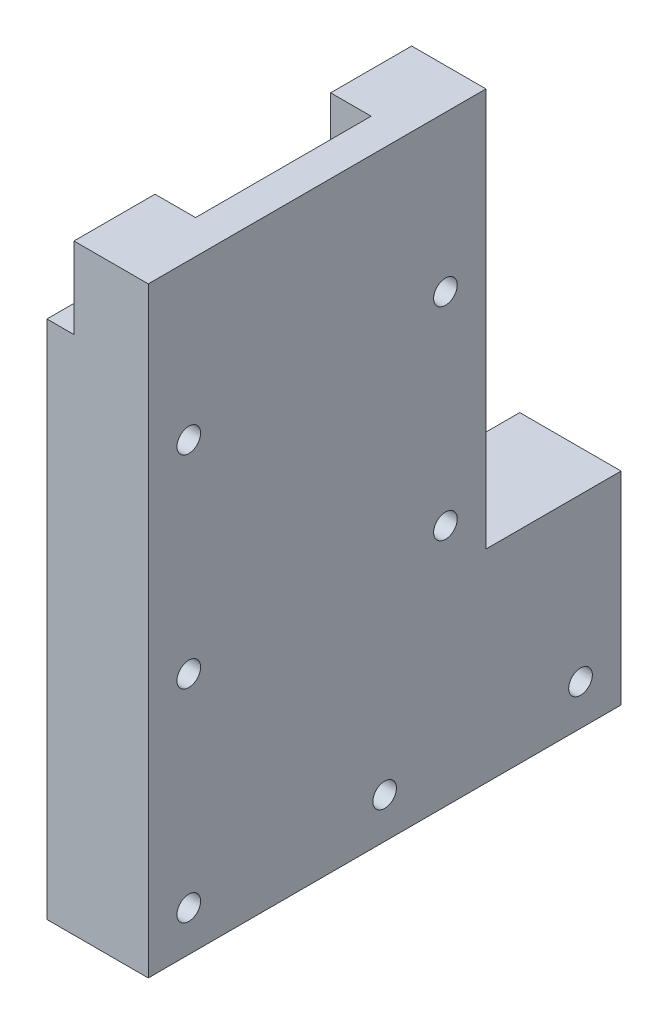
ISO-10303-21;
HEADER;
FILE_DESCRIPTION(('STEP AP214'),'2;1');
FILE_NAME('part.step','',(''),(''),'','','');
FILE_SCHEMA(('AUTOMOTIVE_DESIGN { 1 0 10303 214 1 1 1 1 }'));
ENDSEC;
DATA;
#1=APPLICATION_CONTEXT('core data for automotive mechanical design processes');
#2=APPLICATION_PROTOCOL_DEFINITION('international standard','automotive_design',2000,#1);
#3=PRODUCT_CONTEXT('',#1,'mechanical');
#4=PRODUCT('Part','Part','',(#3));
#5=PRODUCT_RELATED_PRODUCT_CATEGORY('part','',(#4));
#6=PRODUCT_DEFINITION_FORMATION('','',#4);
#7=PRODUCT_DEFINITION_CONTEXT('part definition',#1,'design');
#8=PRODUCT_DEFINITION('design','',#6,#7);
#9=PRODUCT_DEFINITION_SHAPE('','',#8);
#10=(LENGTH_UNIT() NAMED_UNIT(*) SI_UNIT(.MILLI.,.METRE.));
#11=(NAMED_UNIT(*) PLANE_ANGLE_UNIT() SI_UNIT($,.RADIAN.));
#12=(NAMED_UNIT(*) SI_UNIT($,.STERADIAN.) SOLID_ANGLE_UNIT());
#13=UNCERTAINTY_MEASURE_WITH_UNIT(LENGTH_MEASURE(1.E-05),#10,'distance_accuracy_value','');
#14=(GEOMETRIC_REPRESENTATION_CONTEXT(3) GLOBAL_UNCERTAINTY_ASSIGNED_CONTEXT((#13)) GLOBAL_UNIT_ASSIGNED_CONTEXT((#10,
#11,#12)) REPRESENTATION_CONTEXT('',''));
#15=CARTESIAN_POINT('',(0.,0.,0.));
#16=DIRECTION('',(0.,0.,1.));
#17=DIRECTION('',(1.,0.,0.));
#18=AXIS2_PLACEMENT_3D('',#15,#16,#17);
#19=CARTESIAN_POINT('',(25.,-32.5,13.));
#20=DIRECTION('',(0.,-1.,0.));
#21=DIRECTION('',(0.,0.,-1.));
#22=AXIS2_PLACEMENT_3D('',#19,#20,#21);
#23=PLANE('',#22);
#24=DIRECTION('',(0.,0.,-1.));
#25=VECTOR('',#24,1.);
#26=CARTESIAN_POINT('',(15.,-32.5,13.));
#27=LINE('',#26,#25);
#28=CARTESIAN_POINT('',(15.,-32.5,11.));
#29=VERTEX_POINT('',#28);
#30=CARTESIAN_POINT('',(15.,-32.5,-31.));
#31=VERTEX_POINT('',#30);
#32=EDGE_CURVE('E213',#29,#31,#27,.T.);
#33=ORIENTED_EDGE('',*,*,#32,.F.);
#34=DIRECTION('',(1.,0.,0.));
#35=VECTOR('',#34,1.);
#36=CARTESIAN_POINT('',(22.,-32.5,11.));
#37=LINE('',#36,#35);
#38=CARTESIAN_POINT('',(25.,-32.5,11.));
#39=VERTEX_POINT('',#38);
#40=EDGE_CURVE('E269',#29,#39,#37,.T.);
#41=ORIENTED_EDGE('',*,*,#40,.T.);
#42=DIRECTION('',(0.,0.,-1.));
#43=VECTOR('',#42,1.);
#44=CARTESIAN_POINT('',(25.,-32.5,13.));
#45=LINE('',#44,#43);
#46=CARTESIAN_POINT('',(25.,-32.5,-31.));
#47=VERTEX_POINT('',#46);
#48=EDGE_CURVE('E329',#39,#47,#45,.T.);
#49=ORIENTED_EDGE('',*,*,#48,.T.);
#50=DIRECTION('',(1.,0.,0.));
#51=VECTOR('',#50,1.);
#52=CARTESIAN_POINT('',(22.,-32.5,-31.));
#53=LINE('',#52,#51);
#54=EDGE_CURVE('E241',#31,#47,#53,.T.);
#55=ORIENTED_EDGE('',*,*,#54,.F.);
#56=EDGE_LOOP('',(#33,#41,#49,#55));
#57=FACE_BOUND('',#56,.T.);
#58=ADVANCED_FACE('F35',(#57),#23,.F.);
#59=CARTESIAN_POINT('',(25.,-29.5,-33.));
#60=DIRECTION('',(0.,0.,-1.));
#61=DIRECTION('',(1.,0.,0.));
#62=AXIS2_PLACEMENT_3D('',#59,#60,#61);
#63=PLANE('',#62);
#64=DIRECTION('',(1.,0.,0.));
#65=VECTOR('',#64,1.);
#66=CARTESIAN_POINT('',(15.,-31.5,-33.));
#67=LINE('',#66,#65);
#68=CARTESIAN_POINT('',(15.,-31.5,-33.));
#69=VERTEX_POINT('',#68);
#70=CARTESIAN_POINT('',(22.,-31.5,-33.));
#71=VERTEX_POINT('',#70);
#72=EDGE_CURVE('E203',#69,#71,#67,.T.);
#73=ORIENTED_EDGE('',*,*,#72,.T.);
#74=DIRECTION('',(0.,1.,0.));
#75=VECTOR('',#74,1.);
#76=CARTESIAN_POINT('',(22.,-32.5,-33.));
#77=LINE('',#76,#75);
#78=CARTESIAN_POINT('',(22.,-30.5,-33.));
#79=VERTEX_POINT('',#78);
#80=EDGE_CURVE('E233',#71,#79,#77,.T.);
#81=ORIENTED_EDGE('',*,*,#80,.T.);
#82=DIRECTION('',(1.,0.,0.));
#83=VECTOR('',#82,1.);
#84=CARTESIAN_POINT('',(22.,-30.5,-33.));
#85=LINE('',#84,#83);
#86=CARTESIAN_POINT('',(25.,-30.5,-33.));
#87=VERTEX_POINT('',#86);
#88=EDGE_CURVE('E248',#79,#87,#85,.T.);
#89=ORIENTED_EDGE('',*,*,#88,.T.);
#90=DIRECTION('',(0.,1.,0.));
#91=VECTOR('',#90,1.);
#92=CARTESIAN_POINT('',(25.,-29.5,-33.));
#93=LINE('',#92,#91);
#94=CARTESIAN_POINT('',(25.,-29.5,-33.));
#95=VERTEX_POINT('',#94);
#96=EDGE_CURVE('E313',#87,#95,#93,.T.);
#97=ORIENTED_EDGE('',*,*,#96,.T.);
#98=DIRECTION('',(-1.,0.,0.));
#99=VECTOR('',#98,1.);
#100=CARTESIAN_POINT('',(25.,-29.5,-33.));
#101=LINE('',#100,#99);
#102=CARTESIAN_POINT('',(15.,-29.5,-33.));
#103=VERTEX_POINT('',#102);
#104=EDGE_CURVE('E320',#95,#103,#101,.T.);
#105=ORIENTED_EDGE('',*,*,#104,.T.);
#106=DIRECTION('',(0.,1.,0.));
#107=VECTOR('',#106,1.);
#108=CARTESIAN_POINT('',(15.,-29.5,-33.));
#109=LINE('',#108,#107);
#110=EDGE_CURVE('E314',#69,#103,#109,.T.);
#111=ORIENTED_EDGE('',*,*,#110,.F.);
#112=EDGE_LOOP('',(#73,#81,#89,#97,#105,#111));
#113=FACE_BOUND('',#112,.T.);
#114=ADVANCED_FACE('F445',(#113),#63,.F.);
#115=CARTESIAN_POINT('',(22.,0.,0.));
#116=DIRECTION('',(-1.,0.,0.));
#117=DIRECTION('',(0.,0.,-1.));
#118=AXIS2_PLACEMENT_3D('',#115,#116,#117);
#119=PLANE('',#118);
#120=DIRECTION('',(0.,-1.,0.));
#121=VECTOR('',#120,1.);
#122=CARTESIAN_POINT('',(22.,-32.5,-31.));
#123=LINE('',#122,#121);
#124=CARTESIAN_POINT('',(22.,-30.5,-31.));
#125=VERTEX_POINT('',#124);
#126=CARTESIAN_POINT('',(22.,-31.5,-31.));
#127=VERTEX_POINT('',#126);
#128=EDGE_CURVE('E200',#125,#127,#123,.T.);
#129=ORIENTED_EDGE('',*,*,#128,.F.);
#130=DIRECTION('',(0.,0.,1.));
#131=VECTOR('',#130,1.);
#132=CARTESIAN_POINT('',(22.,-30.5,-33.));
#133=LINE('',#132,#131);
#134=EDGE_CURVE('E236',#79,#125,#133,.T.);
#135=ORIENTED_EDGE('',*,*,#134,.F.);
#136=ORIENTED_EDGE('',*,*,#80,.F.);
#137=DIRECTION('',(0.,0.,1.));
#138=VECTOR('',#137,1.);
#139=CARTESIAN_POINT('',(22.,-31.5,-33.));
#140=LINE('',#139,#138);
#141=EDGE_CURVE('E208',#71,#127,#140,.T.);
#142=ORIENTED_EDGE('',*,*,#141,.T.);
#143=EDGE_LOOP('',(#129,#135,#136,#142));
#144=FACE_BOUND('',#143,.T.);
#145=ADVANCED_FACE('F443',(#144),#119,.T.);
#146=CARTESIAN_POINT('',(25.,44.5,13.));
#147=DIRECTION('',(0.,0.,1.));
#148=DIRECTION('',(0.,-1.,0.));
#149=AXIS2_PLACEMENT_3D('',#146,#147,#148);
#150=PLANE('',#149);
#151=DIRECTION('',(1.,0.,0.));
#152=VECTOR('',#151,1.);
#153=CARTESIAN_POINT('',(15.,-31.5,13.));
#154=LINE('',#153,#152);
#155=CARTESIAN_POINT('',(15.,-31.5,13.));
#156=VERTEX_POINT('',#155);
#157=CARTESIAN_POINT('',(22.,-31.5,13.));
#158=VERTEX_POINT('',#157);
#159=EDGE_CURVE('E226',#156,#158,#154,.T.);
#160=ORIENTED_EDGE('',*,*,#159,.F.);
#161=DIRECTION('',(0.,-1.,0.));
#162=VECTOR('',#161,1.);
#163=CARTESIAN_POINT('',(15.,44.5,13.));
#164=LINE('',#163,#162);
#165=CARTESIAN_POINT('',(15.,32.5,13.));
#166=VERTEX_POINT('',#165);
#167=EDGE_CURVE('E323',#166,#156,#164,.T.);
#168=ORIENTED_EDGE('',*,*,#167,.F.);
#169=DIRECTION('',(-1.,0.,0.));
#170=VECTOR('',#169,1.);
#171=CARTESIAN_POINT('',(19.,32.5,13.));
#172=LINE('',#171,#170);
#173=CARTESIAN_POINT('',(19.,32.5,13.));
#174=VERTEX_POINT('',#173);
#175=EDGE_CURVE('E288',#174,#166,#172,.T.);
#176=ORIENTED_EDGE('',*,*,#175,.F.);
#177=DIRECTION('',(0.,1.,0.));
#178=VECTOR('',#177,1.);
#179=CARTESIAN_POINT('',(19.,44.5,13.));
#180=LINE('',#179,#178);
#181=CARTESIAN_POINT('',(19.,44.5,13.));
#182=VERTEX_POINT('',#181);
#183=EDGE_CURVE('E279',#174,#182,#180,.T.);
#184=ORIENTED_EDGE('',*,*,#183,.T.);
#185=DIRECTION('',(-1.,0.,0.));
#186=VECTOR('',#185,1.);
#187=CARTESIAN_POINT('',(25.,44.5,13.));
#188=LINE('',#187,#186);
#189=CARTESIAN_POINT('',(25.,44.5,13.));
#190=VERTEX_POINT('',#189);
#191=EDGE_CURVE('E344',#190,#182,#188,.T.);
#192=ORIENTED_EDGE('',*,*,#191,.F.);
#193=DIRECTION('',(0.,-1.,0.));
#194=VECTOR('',#193,1.);
#195=CARTESIAN_POINT('',(25.,44.5,13.));
#196=LINE('',#195,#194);
#197=CARTESIAN_POINT('',(25.,-30.5,13.));
#198=VERTEX_POINT('',#197);
#199=EDGE_CURVE('E326',#190,#198,#196,.T.);
#200=ORIENTED_EDGE('',*,*,#199,.T.);
#201=DIRECTION('',(1.,0.,0.));
#202=VECTOR('',#201,1.);
#203=CARTESIAN_POINT('',(22.,-30.5,13.));
#204=LINE('',#203,#202);
#205=CARTESIAN_POINT('',(22.,-30.5,13.));
#206=VERTEX_POINT('',#205);
#207=EDGE_CURVE('E261',#206,#198,#204,.T.);
#208=ORIENTED_EDGE('',*,*,#207,.F.);
#209=DIRECTION('',(0.,-1.,0.));
#210=VECTOR('',#209,1.);
#211=CARTESIAN_POINT('',(22.,-32.5,13.));
#212=LINE('',#211,#210);
#213=EDGE_CURVE('E252',#206,#158,#212,.T.);
#214=ORIENTED_EDGE('',*,*,#213,.T.);
#215=EDGE_LOOP('',(#160,#168,#176,#184,#192,#200,#208,#214));
#216=FACE_BOUND('',#215,.T.);
#217=ADVANCED_FACE('F424',(#216),#150,.F.);
#218=CARTESIAN_POINT('',(22.,0.,0.));
#219=DIRECTION('',(1.,0.,0.));
#220=DIRECTION('',(0.,0.,1.));
#221=AXIS2_PLACEMENT_3D('',#218,#219,#220);
#222=PLANE('',#221);
#223=DIRECTION('',(0.,0.,1.));
#224=VECTOR('',#223,1.);
#225=CARTESIAN_POINT('',(22.,-31.5,13.));
#226=LINE('',#225,#224);
#227=CARTESIAN_POINT('',(22.,-31.5,11.));
#228=VERTEX_POINT('',#227);
#229=EDGE_CURVE('E220',#228,#158,#226,.T.);
#230=ORIENTED_EDGE('',*,*,#229,.T.);
#231=ORIENTED_EDGE('',*,*,#213,.F.);
#232=DIRECTION('',(0.,0.,1.));
#233=VECTOR('',#232,1.);
#234=CARTESIAN_POINT('',(22.,-30.5,13.));
#235=LINE('',#234,#233);
#236=CARTESIAN_POINT('',(22.,-30.5,11.));
#237=VERTEX_POINT('',#236);
#238=EDGE_CURVE('E259',#237,#206,#235,.T.);
#239=ORIENTED_EDGE('',*,*,#238,.F.);
#240=DIRECTION('',(0.,1.,0.));
#241=VECTOR('',#240,1.);
#242=CARTESIAN_POINT('',(22.,-32.5,11.));
#243=LINE('',#242,#241);
#244=EDGE_CURVE('E255',#228,#237,#243,.T.);
#245=ORIENTED_EDGE('',*,*,#244,.F.);
#246=EDGE_LOOP('',(#230,#231,#239,#245));
#247=FACE_BOUND('',#246,.T.);
#248=ADVANCED_FACE('F486',(#247),#222,.F.);
#249=CARTESIAN_POINT('',(25.,0.,0.));
#250=DIRECTION('',(-1.,0.,0.));
#251=DIRECTION('',(0.,0.,-1.));
#252=AXIS2_PLACEMENT_3D('',#249,#250,#251);
#253=PLANE('',#252);
#254=DIRECTION('',(0.,-1.,0.));
#255=VECTOR('',#254,1.);
#256=CARTESIAN_POINT('',(25.,-32.5,-31.));
#257=LINE('',#256,#255);
#258=CARTESIAN_POINT('',(25.,-30.5,-31.));
#259=VERTEX_POINT('',#258);
#260=EDGE_CURVE('E237',#259,#47,#257,.T.);
#261=ORIENTED_EDGE('',*,*,#260,.T.);
#262=ORIENTED_EDGE('',*,*,#48,.F.);
#263=DIRECTION('',(0.,1.,0.));
#264=VECTOR('',#263,1.);
#265=CARTESIAN_POINT('',(25.,-32.5,11.));
#266=LINE('',#265,#264);
#267=CARTESIAN_POINT('',(25.,-30.5,11.));
#268=VERTEX_POINT('',#267);
#269=EDGE_CURVE('E251',#39,#268,#266,.T.);
#270=ORIENTED_EDGE('',*,*,#269,.T.);
#271=DIRECTION('',(0.,0.,1.));
#272=VECTOR('',#271,1.);
#273=CARTESIAN_POINT('',(25.,-30.5,13.));
#274=LINE('',#273,#272);
#275=EDGE_CURVE('E256',#268,#198,#274,.T.);
#276=ORIENTED_EDGE('',*,*,#275,.T.);
#277=ORIENTED_EDGE('',*,*,#199,.F.);
#278=DIRECTION('',(0.,0.,1.));
#279=VECTOR('',#278,1.);
#280=CARTESIAN_POINT('',(25.,44.5,13.));
#281=LINE('',#280,#279);
#282=CARTESIAN_POINT('',(25.,44.5,-13.));
#283=VERTEX_POINT('',#282);
#284=EDGE_CURVE('E336',#283,#190,#281,.T.);
#285=ORIENTED_EDGE('',*,*,#284,.F.);
#286=DIRECTION('',(0.,1.,0.));
#287=VECTOR('',#286,1.);
#288=CARTESIAN_POINT('',(25.,44.5,-13.));
#289=LINE('',#288,#287);
#290=CARTESIAN_POINT('',(25.,-9.50000000000001,-13.));
#291=VERTEX_POINT('',#290);
#292=EDGE_CURVE('E333',#291,#283,#289,.T.);
#293=ORIENTED_EDGE('',*,*,#292,.F.);
#294=CARTESIAN_POINT('',(25.,-9.50000000000001,-33.));
#295=DIRECTION('',(-1.,0.,0.));
#296=DIRECTION('',(0.,0.,-1.));
#297=AXIS2_PLACEMENT_3D('',#294,#295,#296);
#298=CIRCLE('',#297,20.);
#299=EDGE_CURVE('E310',#95,#291,#298,.T.);
#300=ORIENTED_EDGE('',*,*,#299,.F.);
#301=ORIENTED_EDGE('',*,*,#96,.F.);
#302=DIRECTION('',(0.,0.,1.));
#303=VECTOR('',#302,1.);
#304=CARTESIAN_POINT('',(25.,-30.5,-33.));
#305=LINE('',#304,#303);
#306=EDGE_CURVE('E232',#87,#259,#305,.T.);
#307=ORIENTED_EDGE('',*,*,#306,.T.);
#308=EDGE_LOOP('',(#261,#262,#270,#276,#277,#285,#293,#300,#301,#307));
#309=FACE_BOUND('',#308,.T.);
#310=ADVANCED_FACE('F436',(#309),#253,.T.);
#311=CARTESIAN_POINT('',(15.,44.5,25.));
#312=DIRECTION('',(0.,-1.,0.));
#313=DIRECTION('',(0.,0.,-1.));
#314=AXIS2_PLACEMENT_3D('',#311,#312,#313);
#315=PLANE('',#314);
#316=DIRECTION('',(0.,0.,1.));
#317=VECTOR('',#316,1.);
#318=CARTESIAN_POINT('',(19.,44.5,25.));
#319=LINE('',#318,#317);
#320=CARTESIAN_POINT('',(19.,44.5,25.));
#321=VERTEX_POINT('',#320);
#322=EDGE_CURVE('E282',#182,#321,#319,.T.);
#323=ORIENTED_EDGE('',*,*,#322,.T.);
#324=DIRECTION('',(1.,0.,0.));
#325=VECTOR('',#324,1.);
#326=CARTESIAN_POINT('',(15.,44.5,25.));
#327=LINE('',#326,#325);
#328=CARTESIAN_POINT('',(30.,44.5,25.));
#329=VERTEX_POINT('',#328);
#330=EDGE_CURVE('E382',#321,#329,#327,.T.);
#331=ORIENTED_EDGE('',*,*,#330,.T.);
#332=DIRECTION('',(0.,0.,1.));
#333=VECTOR('',#332,1.);
#334=CARTESIAN_POINT('',(30.,44.5,25.));
#335=LINE('',#334,#333);
#336=CARTESIAN_POINT('',(30.,44.5,-25.));
#337=VERTEX_POINT('',#336);
#338=EDGE_CURVE('E373',#337,#329,#335,.T.);
#339=ORIENTED_EDGE('',*,*,#338,.F.);
#340=DIRECTION('',(1.,0.,0.));
#341=VECTOR('',#340,1.);
#342=CARTESIAN_POINT('',(15.,44.5,-25.));
#343=LINE('',#342,#341);
#344=CARTESIAN_POINT('',(19.,44.5,-25.));
#345=VERTEX_POINT('',#344);
#346=EDGE_CURVE('E385',#345,#337,#343,.T.);
#347=ORIENTED_EDGE('',*,*,#346,.F.);
#348=DIRECTION('',(0.,0.,1.));
#349=VECTOR('',#348,1.);
#350=CARTESIAN_POINT('',(19.,44.5,-13.));
#351=LINE('',#350,#349);
#352=CARTESIAN_POINT('',(19.,44.5,-13.));
#353=VERTEX_POINT('',#352);
#354=EDGE_CURVE('E301',#345,#353,#351,.T.);
#355=ORIENTED_EDGE('',*,*,#354,.T.);
#356=DIRECTION('',(-1.,0.,0.));
#357=VECTOR('',#356,1.);
#358=CARTESIAN_POINT('',(25.,44.5,-13.));
#359=LINE('',#358,#357);
#360=EDGE_CURVE('E338',#283,#353,#359,.T.);
#361=ORIENTED_EDGE('',*,*,#360,.F.);
#362=ORIENTED_EDGE('',*,*,#284,.T.);
#363=ORIENTED_EDGE('',*,*,#191,.T.);
#364=EDGE_LOOP('',(#323,#331,#339,#347,#355,#361,#362,#363));
#365=FACE_BOUND('',#364,.T.);
#366=ADVANCED_FACE('F412',(#365),#315,.F.);
#367=CARTESIAN_POINT('',(25.,44.5,-13.));
#368=DIRECTION('',(0.,0.,-1.));
#369=DIRECTION('',(0.,1.,0.));
#370=AXIS2_PLACEMENT_3D('',#367,#368,#369);
#371=PLANE('',#370);
#372=DIRECTION('',(0.,1.,0.));
#373=VECTOR('',#372,1.);
#374=CARTESIAN_POINT('',(15.,44.5,-13.));
#375=LINE('',#374,#373);
#376=CARTESIAN_POINT('',(15.,-9.50000000000001,-13.));
#377=VERTEX_POINT('',#376);
#378=CARTESIAN_POINT('',(15.,32.5,-13.));
#379=VERTEX_POINT('',#378);
#380=EDGE_CURVE('E330',#377,#379,#375,.T.);
#381=ORIENTED_EDGE('',*,*,#380,.F.);
#382=DIRECTION('',(-1.,0.,0.));
#383=VECTOR('',#382,1.);
#384=CARTESIAN_POINT('',(25.,-9.50000000000001,-13.));
#385=LINE('',#384,#383);
#386=EDGE_CURVE('E317',#291,#377,#385,.T.);
#387=ORIENTED_EDGE('',*,*,#386,.F.);
#388=ORIENTED_EDGE('',*,*,#292,.T.);
#389=ORIENTED_EDGE('',*,*,#360,.T.);
#390=DIRECTION('',(0.,-1.,0.));
#391=VECTOR('',#390,1.);
#392=CARTESIAN_POINT('',(19.,44.5,-13.));
#393=LINE('',#392,#391);
#394=CARTESIAN_POINT('',(19.,32.5,-13.));
#395=VERTEX_POINT('',#394);
#396=EDGE_CURVE('E294',#353,#395,#393,.T.);
#397=ORIENTED_EDGE('',*,*,#396,.T.);
#398=DIRECTION('',(-1.,0.,0.));
#399=VECTOR('',#398,1.);
#400=CARTESIAN_POINT('',(19.,32.5,-13.));
#401=LINE('',#400,#399);
#402=EDGE_CURVE('E304',#395,#379,#401,.T.);
#403=ORIENTED_EDGE('',*,*,#402,.T.);
#404=EDGE_LOOP('',(#381,#387,#388,#389,#397,#403));
#405=FACE_BOUND('',#404,.T.);
#406=ADVANCED_FACE('F452',(#405),#371,.F.);
#407=CARTESIAN_POINT('',(15.,-14.5,-45.));
#408=DIRECTION('',(0.,0.,1.));
#409=DIRECTION('',(0.,-1.,0.));
#410=AXIS2_PLACEMENT_3D('',#407,#408,#409);
#411=PLANE('',#410);
#412=DIRECTION('',(0.,1.,0.));
#413=VECTOR('',#412,1.);
#414=CARTESIAN_POINT('',(30.,-14.5,-45.));
#415=LINE('',#414,#413);
#416=CARTESIAN_POINT('',(30.,-44.5,-45.));
#417=VERTEX_POINT('',#416);
#418=CARTESIAN_POINT('',(30.,-14.5,-45.));
#419=VERTEX_POINT('',#418);
#420=EDGE_CURVE('E347',#417,#419,#415,.T.);
#421=ORIENTED_EDGE('',*,*,#420,.F.);
#422=DIRECTION('',(1.,0.,0.));
#423=VECTOR('',#422,1.);
#424=CARTESIAN_POINT('',(15.,-44.5,-45.));
#425=LINE('',#424,#423);
#426=CARTESIAN_POINT('',(15.,-44.5,-45.));
#427=VERTEX_POINT('',#426);
#428=EDGE_CURVE('E11',#427,#417,#425,.T.);
#429=ORIENTED_EDGE('',*,*,#428,.F.);
#430=DIRECTION('',(0.,1.,0.));
#431=VECTOR('',#430,1.);
#432=CARTESIAN_POINT('',(15.,-14.5,-45.));
#433=LINE('',#432,#431);
#434=CARTESIAN_POINT('',(15.,-14.5,-45.));
#435=VERTEX_POINT('',#434);
#436=EDGE_CURVE('E352',#427,#435,#433,.T.);
#437=ORIENTED_EDGE('',*,*,#436,.T.);
#438=DIRECTION('',(1.,0.,0.));
#439=VECTOR('',#438,1.);
#440=CARTESIAN_POINT('',(15.,-14.5,-45.));
#441=LINE('',#440,#439);
#442=EDGE_CURVE('E43',#435,#419,#441,.T.);
#443=ORIENTED_EDGE('',*,*,#442,.T.);
#444=EDGE_LOOP('',(#421,#429,#437,#443));
#445=FACE_BOUND('',#444,.T.);
#446=ADVANCED_FACE('F37',(#445),#411,.F.);
#447=CARTESIAN_POINT('',(15.,-14.5,-25.));
#448=DIRECTION('',(0.,-1.,0.));
#449=DIRECTION('',(0.,0.,-1.));
#450=AXIS2_PLACEMENT_3D('',#447,#448,#449);
#451=PLANE('',#450);
#452=DIRECTION('',(0.,0.,1.));
#453=VECTOR('',#452,1.);
#454=CARTESIAN_POINT('',(30.,-14.5,-25.));
#455=LINE('',#454,#453);
#456=CARTESIAN_POINT('',(30.,-14.5,-25.));
#457=VERTEX_POINT('',#456);
#458=EDGE_CURVE('E368',#419,#457,#455,.T.);
#459=ORIENTED_EDGE('',*,*,#458,.F.);
#460=ORIENTED_EDGE('',*,*,#442,.F.);
#461=DIRECTION('',(0.,0.,1.));
#462=VECTOR('',#461,1.);
#463=CARTESIAN_POINT('',(15.,-14.5,-25.));
#464=LINE('',#463,#462);
#465=CARTESIAN_POINT('',(15.,-14.5,-25.));
#466=VERTEX_POINT('',#465);
#467=EDGE_CURVE('E356',#435,#466,#464,.T.);
#468=ORIENTED_EDGE('',*,*,#467,.T.);
#469=DIRECTION('',(1.,0.,0.));
#470=VECTOR('',#469,1.);
#471=CARTESIAN_POINT('',(15.,-14.5,-25.));
#472=LINE('',#471,#470);
#473=EDGE_CURVE('E388',#466,#457,#472,.T.);
#474=ORIENTED_EDGE('',*,*,#473,.T.);
#475=EDGE_LOOP('',(#459,#460,#468,#474));
#476=FACE_BOUND('',#475,.T.);
#477=ADVANCED_FACE('F404',(#476),#451,.F.);
#478=CARTESIAN_POINT('',(15.,44.5,-25.));
#479=DIRECTION('',(0.,0.,1.));
#480=DIRECTION('',(0.,-1.,0.));
#481=AXIS2_PLACEMENT_3D('',#478,#479,#480);
#482=PLANE('',#481);
#483=DIRECTION('',(0.,1.,0.));
#484=VECTOR('',#483,1.);
#485=CARTESIAN_POINT('',(19.,44.5,-25.));
#486=LINE('',#485,#484);
#487=CARTESIAN_POINT('',(19.,32.5,-25.));
#488=VERTEX_POINT('',#487);
#489=EDGE_CURVE('E299',#488,#345,#486,.T.);
#490=ORIENTED_EDGE('',*,*,#489,.T.);
#491=ORIENTED_EDGE('',*,*,#346,.T.);
#492=DIRECTION('',(0.,1.,0.));
#493=VECTOR('',#492,1.);
#494=CARTESIAN_POINT('',(30.,44.5,-25.));
#495=LINE('',#494,#493);
#496=EDGE_CURVE('E371',#457,#337,#495,.T.);
#497=ORIENTED_EDGE('',*,*,#496,.F.);
#498=ORIENTED_EDGE('',*,*,#473,.F.);
#499=DIRECTION('',(0.,1.,0.));
#500=VECTOR('',#499,1.);
#501=CARTESIAN_POINT('',(15.,44.5,-25.));
#502=LINE('',#501,#500);
#503=CARTESIAN_POINT('',(15.,32.5,-25.));
#504=VERTEX_POINT('',#503);
#505=EDGE_CURVE('E359',#466,#504,#502,.T.);
#506=ORIENTED_EDGE('',*,*,#505,.T.);
#507=DIRECTION('',(-1.,0.,0.));
#508=VECTOR('',#507,1.);
#509=CARTESIAN_POINT('',(19.,32.5,-25.));
#510=LINE('',#509,#508);
#511=EDGE_CURVE('E287',#488,#504,#510,.T.);
#512=ORIENTED_EDGE('',*,*,#511,.F.);
#513=EDGE_LOOP('',(#490,#491,#497,#498,#506,#512));
#514=FACE_BOUND('',#513,.T.);
#515=ADVANCED_FACE('F406',(#514),#482,.F.);
#516=CARTESIAN_POINT('',(15.,44.5,25.));
#517=DIRECTION('',(0.,0.,-1.));
#518=DIRECTION('',(0.,1.,0.));
#519=AXIS2_PLACEMENT_3D('',#516,#517,#518);
#520=PLANE('',#519);
#521=DIRECTION('',(0.,-1.,0.));
#522=VECTOR('',#521,1.);
#523=CARTESIAN_POINT('',(15.,44.5,25.));
#524=LINE('',#523,#522);
#525=CARTESIAN_POINT('',(15.,32.5,25.));
#526=VERTEX_POINT('',#525);
#527=CARTESIAN_POINT('',(15.,-44.5,25.));
#528=VERTEX_POINT('',#527);
#529=EDGE_CURVE('E362',#526,#528,#524,.T.);
#530=ORIENTED_EDGE('',*,*,#529,.T.);
#531=DIRECTION('',(1.,0.,0.));
#532=VECTOR('',#531,1.);
#533=CARTESIAN_POINT('',(15.,-44.5,25.));
#534=LINE('',#533,#532);
#535=CARTESIAN_POINT('',(30.,-44.5,25.));
#536=VERTEX_POINT('',#535);
#537=EDGE_CURVE('E365',#528,#536,#534,.T.);
#538=ORIENTED_EDGE('',*,*,#537,.T.);
#539=DIRECTION('',(0.,-1.,0.));
#540=VECTOR('',#539,1.);
#541=CARTESIAN_POINT('',(30.,44.5,25.));
#542=LINE('',#541,#540);
#543=EDGE_CURVE('E376',#329,#536,#542,.T.);
#544=ORIENTED_EDGE('',*,*,#543,.F.);
#545=ORIENTED_EDGE('',*,*,#330,.F.);
#546=DIRECTION('',(0.,-1.,0.));
#547=VECTOR('',#546,1.);
#548=CARTESIAN_POINT('',(19.,44.5,25.));
#549=LINE('',#548,#547);
#550=CARTESIAN_POINT('',(19.,32.5,25.));
#551=VERTEX_POINT('',#550);
#552=EDGE_CURVE('E273',#321,#551,#549,.T.);
#553=ORIENTED_EDGE('',*,*,#552,.T.);
#554=DIRECTION('',(-1.,0.,0.));
#555=VECTOR('',#554,1.);
#556=CARTESIAN_POINT('',(19.,32.5,25.));
#557=LINE('',#556,#555);
#558=EDGE_CURVE('E285',#551,#526,#557,.T.);
#559=ORIENTED_EDGE('',*,*,#558,.T.);
#560=EDGE_LOOP('',(#530,#538,#544,#545,#553,#559));
#561=FACE_BOUND('',#560,.T.);
#562=ADVANCED_FACE('F414',(#561),#520,.F.);
#563=CARTESIAN_POINT('',(15.,-44.5,25.));
#564=DIRECTION('',(0.,1.,0.));
#565=DIRECTION('',(0.,0.,1.));
#566=AXIS2_PLACEMENT_3D('',#563,#564,#565);
#567=PLANE('',#566);
#568=DIRECTION('',(0.,0.,-1.));
#569=VECTOR('',#568,1.);
#570=CARTESIAN_POINT('',(30.,-44.5,25.));
#571=LINE('',#570,#569);
#572=EDGE_CURVE('E353',#536,#417,#571,.T.);
#573=ORIENTED_EDGE('',*,*,#572,.F.);
#574=ORIENTED_EDGE('',*,*,#537,.F.);
#575=DIRECTION('',(0.,0.,-1.));
#576=VECTOR('',#575,1.);
#577=CARTESIAN_POINT('',(15.,-44.5,-25.));
#578=LINE('',#577,#576);
#579=EDGE_CURVE('E350',#528,#427,#578,.T.);
#580=ORIENTED_EDGE('',*,*,#579,.T.);
#581=ORIENTED_EDGE('',*,*,#428,.T.);
#582=EDGE_LOOP('',(#573,#574,#580,#581));
#583=FACE_BOUND('',#582,.T.);
#584=ADVANCED_FACE('F401',(#583),#567,.F.);
#585=CARTESIAN_POINT('',(15.,0.,0.));
#586=DIRECTION('',(1.,0.,0.));
#587=DIRECTION('',(0.,0.,1.));
#588=AXIS2_PLACEMENT_3D('',#585,#586,#587);
#589=PLANE('',#588);
#590=CARTESIAN_POINT('',(15.,-8.50000000000001,19.));
#591=DIRECTION('',(1.,0.,0.));
#592=DIRECTION('',(0.,0.,-1.));
#593=AXIS2_PLACEMENT_3D('',#590,#591,#592);
#594=CIRCLE('',#593,1.75);
#595=CARTESIAN_POINT('',(15.,-8.50000000000001,17.25));
#596=VERTEX_POINT('',#595);
#597=EDGE_CURVE('E768',#596,#596,#594,.T.);
#598=ORIENTED_EDGE('',*,*,#597,.T.);
#599=EDGE_LOOP('',(#598));
#600=FACE_BOUND('',#599,.T.);
#601=CARTESIAN_POINT('',(15.,-38.5,19.));
#602=DIRECTION('',(1.,0.,0.));
#603=DIRECTION('',(0.,0.,-1.));
#604=AXIS2_PLACEMENT_3D('',#601,#602,#603);
#605=CIRCLE('',#604,1.75);
#606=CARTESIAN_POINT('',(15.,-38.5,17.25));
#607=VERTEX_POINT('',#606);
#608=EDGE_CURVE('E774',#607,#607,#605,.T.);
#609=ORIENTED_EDGE('',*,*,#608,.T.);
#610=EDGE_LOOP('',(#609));
#611=FACE_BOUND('',#610,.T.);
#612=CARTESIAN_POINT('',(15.,-38.5,-9.99999999999997));
#613=DIRECTION('',(1.,0.,0.));
#614=DIRECTION('',(0.,0.,-1.));
#615=AXIS2_PLACEMENT_3D('',#612,#613,#614);
#616=CIRCLE('',#615,1.75);
#617=CARTESIAN_POINT('',(15.,-38.5,-11.75));
#618=VERTEX_POINT('',#617);
#619=EDGE_CURVE('E783',#618,#618,#616,.T.);
#620=ORIENTED_EDGE('',*,*,#619,.T.);
#621=EDGE_LOOP('',(#620));
#622=FACE_BOUND('',#621,.T.);
#623=CARTESIAN_POINT('',(15.,-38.5,-39.));
#624=DIRECTION('',(1.,0.,0.));
#625=DIRECTION('',(0.,0.,-1.));
#626=AXIS2_PLACEMENT_3D('',#623,#624,#625);
#627=CIRCLE('',#626,1.75);
#628=CARTESIAN_POINT('',(15.,-38.5,-40.75));
#629=VERTEX_POINT('',#628);
#630=EDGE_CURVE('E789',#629,#629,#627,.T.);
#631=ORIENTED_EDGE('',*,*,#630,.T.);
#632=EDGE_LOOP('',(#631));
#633=FACE_BOUND('',#632,.T.);
#634=CARTESIAN_POINT('',(15.,-8.50000000000001,-19.));
#635=DIRECTION('',(1.,0.,0.));
#636=DIRECTION('',(0.,0.,-1.));
#637=AXIS2_PLACEMENT_3D('',#634,#635,#636);
#638=CIRCLE('',#637,1.75);
#639=CARTESIAN_POINT('',(15.,-8.50000000000001,-20.75));
#640=VERTEX_POINT('',#639);
#641=EDGE_CURVE('E803',#640,#640,#638,.T.);
#642=ORIENTED_EDGE('',*,*,#641,.T.);
#643=EDGE_LOOP('',(#642));
#644=FACE_BOUND('',#643,.T.);
#645=CARTESIAN_POINT('',(15.,21.5,-19.));
#646=DIRECTION('',(1.,0.,0.));
#647=DIRECTION('',(0.,0.,-1.));
#648=AXIS2_PLACEMENT_3D('',#645,#646,#647);
#649=CIRCLE('',#648,1.75);
#650=CARTESIAN_POINT('',(15.,21.5,-20.75));
#651=VERTEX_POINT('',#650);
#652=EDGE_CURVE('E811',#651,#651,#649,.T.);
#653=ORIENTED_EDGE('',*,*,#652,.T.);
#654=EDGE_LOOP('',(#653));
#655=FACE_BOUND('',#654,.T.);
#656=CARTESIAN_POINT('',(15.,21.5,19.));
#657=DIRECTION('',(1.,0.,0.));
#658=DIRECTION('',(0.,0.,-1.));
#659=AXIS2_PLACEMENT_3D('',#656,#657,#658);
#660=CIRCLE('',#659,1.75);
#661=CARTESIAN_POINT('',(15.,21.5,17.25));
#662=VERTEX_POINT('',#661);
#663=EDGE_CURVE('E771',#662,#662,#660,.T.);
#664=ORIENTED_EDGE('',*,*,#663,.T.);
#665=EDGE_LOOP('',(#664));
#666=FACE_BOUND('',#665,.T.);
#667=ORIENTED_EDGE('',*,*,#110,.T.);
#668=CARTESIAN_POINT('',(15.,-9.50000000000001,-33.));
#669=DIRECTION('',(-1.,0.,0.));
#670=DIRECTION('',(0.,0.,-1.));
#671=AXIS2_PLACEMENT_3D('',#668,#669,#670);
#672=CIRCLE('',#671,20.);
#673=EDGE_CURVE('E291',#103,#377,#672,.T.);
#674=ORIENTED_EDGE('',*,*,#673,.T.);
#675=ORIENTED_EDGE('',*,*,#380,.T.);
#676=DIRECTION('',(0.,0.,-1.));
#677=VECTOR('',#676,1.);
#678=CARTESIAN_POINT('',(15.,32.5,-13.));
#679=LINE('',#678,#677);
#680=EDGE_CURVE('E272',#379,#504,#679,.T.);
#681=ORIENTED_EDGE('',*,*,#680,.T.);
#682=ORIENTED_EDGE('',*,*,#505,.F.);
#683=ORIENTED_EDGE('',*,*,#467,.F.);
#684=ORIENTED_EDGE('',*,*,#436,.F.);
#685=ORIENTED_EDGE('',*,*,#579,.F.);
#686=ORIENTED_EDGE('',*,*,#529,.F.);
#687=DIRECTION('',(0.,0.,-1.));
#688=VECTOR('',#687,1.);
#689=CARTESIAN_POINT('',(15.,32.5,25.));
#690=LINE('',#689,#688);
#691=EDGE_CURVE('E277',#526,#166,#690,.T.);
#692=ORIENTED_EDGE('',*,*,#691,.T.);
#693=ORIENTED_EDGE('',*,*,#167,.T.);
#694=DIRECTION('',(0.,0.,1.));
#695=VECTOR('',#694,1.);
#696=CARTESIAN_POINT('',(15.,-31.5,13.));
#697=LINE('',#696,#695);
#698=CARTESIAN_POINT('',(15.,-31.5,11.));
#699=VERTEX_POINT('',#698);
#700=EDGE_CURVE('E224',#699,#156,#697,.T.);
#701=ORIENTED_EDGE('',*,*,#700,.F.);
#702=DIRECTION('',(0.,1.,0.));
#703=VECTOR('',#702,1.);
#704=CARTESIAN_POINT('',(15.,-32.5,11.));
#705=LINE('',#704,#703);
#706=EDGE_CURVE('E221',#29,#699,#705,.T.);
#707=ORIENTED_EDGE('',*,*,#706,.F.);
#708=ORIENTED_EDGE('',*,*,#32,.T.);
#709=DIRECTION('',(0.,-1.,0.));
#710=VECTOR('',#709,1.);
#711=CARTESIAN_POINT('',(15.,-32.5,-31.));
#712=LINE('',#711,#710);
#713=CARTESIAN_POINT('',(15.,-31.5,-31.));
#714=VERTEX_POINT('',#713);
#715=EDGE_CURVE('E50',#714,#31,#712,.T.);
#716=ORIENTED_EDGE('',*,*,#715,.F.);
#717=DIRECTION('',(0.,0.,1.));
#718=VECTOR('',#717,1.);
#719=CARTESIAN_POINT('',(15.,-31.5,-33.));
#720=LINE('',#719,#718);
#721=EDGE_CURVE('E57',#69,#714,#720,.T.);
#722=ORIENTED_EDGE('',*,*,#721,.F.);
#723=EDGE_LOOP('',(#667,#674,#675,#681,#682,#683,#684,#685,#686,#692,#693,#701,#707,#708,#716,#722));
#724=FACE_BOUND('',#723,.T.);
#725=ADVANCED_FACE('F211',(#600,#611,#622,#633,#644,#655,#666,#724),#589,.F.);
#726=CARTESIAN_POINT('',(30.,0.,0.));
#727=DIRECTION('',(1.,0.,0.));
#728=DIRECTION('',(0.,0.,1.));
#729=AXIS2_PLACEMENT_3D('',#726,#727,#728);
#730=PLANE('',#729);
#731=CARTESIAN_POINT('',(30.,-8.50000000000001,19.));
#732=DIRECTION('',(1.,0.,0.));
#733=DIRECTION('',(0.,0.,-1.));
#734=AXIS2_PLACEMENT_3D('',#731,#732,#733);
#735=CIRCLE('',#734,1.75);
#736=CARTESIAN_POINT('',(30.,-8.50000000000001,17.25));
#737=VERTEX_POINT('',#736);
#738=EDGE_CURVE('E765',#737,#737,#735,.T.);
#739=ORIENTED_EDGE('',*,*,#738,.F.);
#740=EDGE_LOOP('',(#739));
#741=FACE_BOUND('',#740,.T.);
#742=CARTESIAN_POINT('',(30.,-38.5,19.));
#743=DIRECTION('',(1.,0.,0.));
#744=DIRECTION('',(0.,0.,-1.));
#745=AXIS2_PLACEMENT_3D('',#742,#743,#744);
#746=CIRCLE('',#745,1.75);
#747=CARTESIAN_POINT('',(30.,-38.5,17.25));
#748=VERTEX_POINT('',#747);
#749=EDGE_CURVE('E769',#748,#748,#746,.T.);
#750=ORIENTED_EDGE('',*,*,#749,.F.);
#751=EDGE_LOOP('',(#750));
#752=FACE_BOUND('',#751,.T.);
#753=CARTESIAN_POINT('',(30.,-38.5,-9.99999999999997));
#754=DIRECTION('',(1.,0.,0.));
#755=DIRECTION('',(0.,0.,-1.));
#756=AXIS2_PLACEMENT_3D('',#753,#754,#755);
#757=CIRCLE('',#756,1.75);
#758=CARTESIAN_POINT('',(30.,-38.5,-11.75));
#759=VERTEX_POINT('',#758);
#760=EDGE_CURVE('E780',#759,#759,#757,.T.);
#761=ORIENTED_EDGE('',*,*,#760,.F.);
#762=EDGE_LOOP('',(#761));
#763=FACE_BOUND('',#762,.T.);
#764=CARTESIAN_POINT('',(30.,-38.5,-39.));
#765=DIRECTION('',(1.,0.,0.));
#766=DIRECTION('',(0.,0.,-1.));
#767=AXIS2_PLACEMENT_3D('',#764,#765,#766);
#768=CIRCLE('',#767,1.75);
#769=CARTESIAN_POINT('',(30.,-38.5,-40.75));
#770=VERTEX_POINT('',#769);
#771=EDGE_CURVE('E786',#770,#770,#768,.T.);
#772=ORIENTED_EDGE('',*,*,#771,.F.);
#773=EDGE_LOOP('',(#772));
#774=FACE_BOUND('',#773,.T.);
#775=CARTESIAN_POINT('',(30.,-8.50000000000001,-19.));
#776=DIRECTION('',(1.,0.,0.));
#777=DIRECTION('',(0.,0.,-1.));
#778=AXIS2_PLACEMENT_3D('',#775,#776,#777);
#779=CIRCLE('',#778,1.75);
#780=CARTESIAN_POINT('',(30.,-8.50000000000001,-20.75));
#781=VERTEX_POINT('',#780);
#782=EDGE_CURVE('E792',#781,#781,#779,.T.);
#783=ORIENTED_EDGE('',*,*,#782,.F.);
#784=EDGE_LOOP('',(#783));
#785=FACE_BOUND('',#784,.T.);
#786=CARTESIAN_POINT('',(30.,21.5,-19.));
#787=DIRECTION('',(1.,0.,0.));
#788=DIRECTION('',(0.,0.,-1.));
#789=AXIS2_PLACEMENT_3D('',#786,#787,#788);
#790=CIRCLE('',#789,1.75);
#791=CARTESIAN_POINT('',(30.,21.5,-20.75));
#792=VERTEX_POINT('',#791);
#793=EDGE_CURVE('E807',#792,#792,#790,.T.);
#794=ORIENTED_EDGE('',*,*,#793,.F.);
#795=EDGE_LOOP('',(#794));
#796=FACE_BOUND('',#795,.T.);
#797=CARTESIAN_POINT('',(30.,21.5,19.));
#798=DIRECTION('',(1.,0.,0.));
#799=DIRECTION('',(0.,0.,-1.));
#800=AXIS2_PLACEMENT_3D('',#797,#798,#799);
#801=CIRCLE('',#800,1.75);
#802=CARTESIAN_POINT('',(30.,21.5,17.25));
#803=VERTEX_POINT('',#802);
#804=EDGE_CURVE('E217',#803,#803,#801,.T.);
#805=ORIENTED_EDGE('',*,*,#804,.F.);
#806=EDGE_LOOP('',(#805));
#807=FACE_BOUND('',#806,.T.);
#808=ORIENTED_EDGE('',*,*,#420,.T.);
#809=ORIENTED_EDGE('',*,*,#458,.T.);
#810=ORIENTED_EDGE('',*,*,#496,.T.);
#811=ORIENTED_EDGE('',*,*,#338,.T.);
#812=ORIENTED_EDGE('',*,*,#543,.T.);
#813=ORIENTED_EDGE('',*,*,#572,.T.);
#814=EDGE_LOOP('',(#808,#809,#810,#811,#812,#813));
#815=FACE_BOUND('',#814,.T.);
#816=ADVANCED_FACE('F398',(#741,#752,#763,#774,#785,#796,#807,#815),#730,.T.);
#817=CARTESIAN_POINT('',(25.,-9.50000000000001,-33.));
#818=DIRECTION('',(-1.,0.,0.));
#819=DIRECTION('',(0.,0.,-1.));
#820=AXIS2_PLACEMENT_3D('',#817,#818,#819);
#821=CYLINDRICAL_SURFACE('',#820,20.);
#822=ORIENTED_EDGE('',*,*,#673,.F.);
#823=ORIENTED_EDGE('',*,*,#104,.F.);
#824=ORIENTED_EDGE('',*,*,#299,.T.);
#825=ORIENTED_EDGE('',*,*,#386,.T.);
#826=EDGE_LOOP('',(#822,#823,#824,#825));
#827=FACE_BOUND('',#826,.T.);
#828=ADVANCED_FACE('F449',(#827),#821,.T.);
#829=CARTESIAN_POINT('',(19.,32.5,25.));
#830=DIRECTION('',(0.,-1.,0.));
#831=DIRECTION('',(0.,0.,-1.));
#832=AXIS2_PLACEMENT_3D('',#829,#830,#831);
#833=PLANE('',#832);
#834=ORIENTED_EDGE('',*,*,#691,.F.);
#835=ORIENTED_EDGE('',*,*,#558,.F.);
#836=DIRECTION('',(0.,0.,-1.));
#837=VECTOR('',#836,1.);
#838=CARTESIAN_POINT('',(19.,32.5,25.));
#839=LINE('',#838,#837);
#840=EDGE_CURVE('E276',#551,#174,#839,.T.);
#841=ORIENTED_EDGE('',*,*,#840,.T.);
#842=ORIENTED_EDGE('',*,*,#175,.T.);
#843=EDGE_LOOP('',(#834,#835,#841,#842));
#844=FACE_BOUND('',#843,.T.);
#845=ADVANCED_FACE('F421',(#844),#833,.F.);
#846=CARTESIAN_POINT('',(19.,0.,0.));
#847=DIRECTION('',(-1.,0.,0.));
#848=DIRECTION('',(0.,0.,-1.));
#849=AXIS2_PLACEMENT_3D('',#846,#847,#848);
#850=PLANE('',#849);
#851=ORIENTED_EDGE('',*,*,#552,.F.);
#852=ORIENTED_EDGE('',*,*,#322,.F.);
#853=ORIENTED_EDGE('',*,*,#183,.F.);
#854=ORIENTED_EDGE('',*,*,#840,.F.);
#855=EDGE_LOOP('',(#851,#852,#853,#854));
#856=FACE_BOUND('',#855,.T.);
#857=ADVANCED_FACE('F465',(#856),#850,.T.);
#858=CARTESIAN_POINT('',(19.,32.5,-13.));
#859=DIRECTION('',(0.,-1.,0.));
#860=DIRECTION('',(0.,0.,-1.));
#861=AXIS2_PLACEMENT_3D('',#858,#859,#860);
#862=PLANE('',#861);
#863=ORIENTED_EDGE('',*,*,#680,.F.);
#864=ORIENTED_EDGE('',*,*,#402,.F.);
#865=DIRECTION('',(0.,0.,-1.));
#866=VECTOR('',#865,1.);
#867=CARTESIAN_POINT('',(19.,32.5,-13.));
#868=LINE('',#867,#866);
#869=EDGE_CURVE('E297',#395,#488,#868,.T.);
#870=ORIENTED_EDGE('',*,*,#869,.T.);
#871=ORIENTED_EDGE('',*,*,#511,.T.);
#872=EDGE_LOOP('',(#863,#864,#870,#871));
#873=FACE_BOUND('',#872,.T.);
#874=ADVANCED_FACE('F455',(#873),#862,.F.);
#875=CARTESIAN_POINT('',(19.,0.,0.));
#876=DIRECTION('',(-1.,0.,0.));
#877=DIRECTION('',(0.,0.,-1.));
#878=AXIS2_PLACEMENT_3D('',#875,#876,#877);
#879=PLANE('',#878);
#880=ORIENTED_EDGE('',*,*,#396,.F.);
#881=ORIENTED_EDGE('',*,*,#354,.F.);
#882=ORIENTED_EDGE('',*,*,#489,.F.);
#883=ORIENTED_EDGE('',*,*,#869,.F.);
#884=EDGE_LOOP('',(#880,#881,#882,#883));
#885=FACE_BOUND('',#884,.T.);
#886=ADVANCED_FACE('F459',(#885),#879,.T.);
#887=CARTESIAN_POINT('',(22.,-32.5,11.));
#888=DIRECTION('',(0.,0.,1.));
#889=DIRECTION('',(-1.,0.,0.));
#890=AXIS2_PLACEMENT_3D('',#887,#888,#889);
#891=PLANE('',#890);
#892=ORIENTED_EDGE('',*,*,#269,.F.);
#893=ORIENTED_EDGE('',*,*,#40,.F.);
#894=ORIENTED_EDGE('',*,*,#706,.T.);
#895=DIRECTION('',(1.,0.,0.));
#896=VECTOR('',#895,1.);
#897=CARTESIAN_POINT('',(15.,-31.5,11.));
#898=LINE('',#897,#896);
#899=EDGE_CURVE('E230',#699,#228,#898,.T.);
#900=ORIENTED_EDGE('',*,*,#899,.T.);
#901=ORIENTED_EDGE('',*,*,#244,.T.);
#902=DIRECTION('',(1.,0.,0.));
#903=VECTOR('',#902,1.);
#904=CARTESIAN_POINT('',(22.,-30.5,11.));
#905=LINE('',#904,#903);
#906=EDGE_CURVE('E267',#237,#268,#905,.T.);
#907=ORIENTED_EDGE('',*,*,#906,.T.);
#908=EDGE_LOOP('',(#892,#893,#894,#900,#901,#907));
#909=FACE_BOUND('',#908,.T.);
#910=ADVANCED_FACE('F432',(#909),#891,.F.);
#911=CARTESIAN_POINT('',(22.,-30.5,13.));
#912=DIRECTION('',(0.,-1.,0.));
#913=DIRECTION('',(0.,0.,-1.));
#914=AXIS2_PLACEMENT_3D('',#911,#912,#913);
#915=PLANE('',#914);
#916=ORIENTED_EDGE('',*,*,#275,.F.);
#917=ORIENTED_EDGE('',*,*,#906,.F.);
#918=ORIENTED_EDGE('',*,*,#238,.T.);
#919=ORIENTED_EDGE('',*,*,#207,.T.);
#920=EDGE_LOOP('',(#916,#917,#918,#919));
#921=FACE_BOUND('',#920,.T.);
#922=ADVANCED_FACE('F641',(#921),#915,.F.);
#923=CARTESIAN_POINT('',(22.,-30.5,-33.));
#924=DIRECTION('',(0.,-1.,0.));
#925=DIRECTION('',(0.,0.,-1.));
#926=AXIS2_PLACEMENT_3D('',#923,#924,#925);
#927=PLANE('',#926);
#928=ORIENTED_EDGE('',*,*,#306,.F.);
#929=ORIENTED_EDGE('',*,*,#88,.F.);
#930=ORIENTED_EDGE('',*,*,#134,.T.);
#931=DIRECTION('',(1.,0.,0.));
#932=VECTOR('',#931,1.);
#933=CARTESIAN_POINT('',(22.,-30.5,-31.));
#934=LINE('',#933,#932);
#935=EDGE_CURVE('E246',#125,#259,#934,.T.);
#936=ORIENTED_EDGE('',*,*,#935,.T.);
#937=EDGE_LOOP('',(#928,#929,#930,#936));
#938=FACE_BOUND('',#937,.T.);
#939=ADVANCED_FACE('F440',(#938),#927,.F.);
#940=CARTESIAN_POINT('',(22.,-32.5,-31.));
#941=DIRECTION('',(0.,0.,-1.));
#942=DIRECTION('',(1.,0.,0.));
#943=AXIS2_PLACEMENT_3D('',#940,#941,#942);
#944=PLANE('',#943);
#945=ORIENTED_EDGE('',*,*,#260,.F.);
#946=ORIENTED_EDGE('',*,*,#935,.F.);
#947=ORIENTED_EDGE('',*,*,#128,.T.);
#948=DIRECTION('',(1.,0.,0.));
#949=VECTOR('',#948,1.);
#950=CARTESIAN_POINT('',(15.,-31.5,-31.));
#951=LINE('',#950,#949);
#952=EDGE_CURVE('E196',#714,#127,#951,.T.);
#953=ORIENTED_EDGE('',*,*,#952,.F.);
#954=ORIENTED_EDGE('',*,*,#715,.T.);
#955=ORIENTED_EDGE('',*,*,#54,.T.);
#956=EDGE_LOOP('',(#945,#946,#947,#953,#954,#955));
#957=FACE_BOUND('',#956,.T.);
#958=ADVANCED_FACE('F198',(#957),#944,.F.);
#959=CARTESIAN_POINT('',(15.,-31.5,13.));
#960=DIRECTION('',(0.,-1.,0.));
#961=DIRECTION('',(0.,0.,-1.));
#962=AXIS2_PLACEMENT_3D('',#959,#960,#961);
#963=PLANE('',#962);
#964=ORIENTED_EDGE('',*,*,#229,.F.);
#965=ORIENTED_EDGE('',*,*,#899,.F.);
#966=ORIENTED_EDGE('',*,*,#700,.T.);
#967=ORIENTED_EDGE('',*,*,#159,.T.);
#968=EDGE_LOOP('',(#964,#965,#966,#967));
#969=FACE_BOUND('',#968,.T.);
#970=ADVANCED_FACE('F429',(#969),#963,.F.);
#971=CARTESIAN_POINT('',(15.,-31.5,-33.));
#972=DIRECTION('',(0.,-1.,0.));
#973=DIRECTION('',(0.,0.,-1.));
#974=AXIS2_PLACEMENT_3D('',#971,#972,#973);
#975=PLANE('',#974);
#976=ORIENTED_EDGE('',*,*,#141,.F.);
#977=ORIENTED_EDGE('',*,*,#72,.F.);
#978=ORIENTED_EDGE('',*,*,#721,.T.);
#979=ORIENTED_EDGE('',*,*,#952,.T.);
#980=EDGE_LOOP('',(#976,#977,#978,#979));
#981=FACE_BOUND('',#980,.T.);
#982=ADVANCED_FACE('F206',(#981),#975,.F.);
#983=CARTESIAN_POINT('',(30.,21.5,19.));
#984=DIRECTION('',(-1.,0.,0.));
#985=DIRECTION('',(0.,0.,-1.));
#986=AXIS2_PLACEMENT_3D('',#983,#984,#985);
#987=CYLINDRICAL_SURFACE('',#986,1.75);
#988=ORIENTED_EDGE('',*,*,#804,.T.);
#989=EDGE_LOOP('',(#988));
#990=FACE_BOUND('',#989,.T.);
#991=ORIENTED_EDGE('',*,*,#663,.F.);
#992=EDGE_LOOP('',(#991));
#993=FACE_BOUND('',#992,.T.);
#994=ADVANCED_FACE('F683',(#990,#993),#987,.F.);
#995=CARTESIAN_POINT('',(30.,21.5,-19.));
#996=DIRECTION('',(-1.,0.,0.));
#997=DIRECTION('',(0.,0.,-1.));
#998=AXIS2_PLACEMENT_3D('',#995,#996,#997);
#999=CYLINDRICAL_SURFACE('',#998,1.75);
#1000=ORIENTED_EDGE('',*,*,#793,.T.);
#1001=EDGE_LOOP('',(#1000));
#1002=FACE_BOUND('',#1001,.T.);
#1003=ORIENTED_EDGE('',*,*,#652,.F.);
#1004=EDGE_LOOP('',(#1003));
#1005=FACE_BOUND('',#1004,.T.);
#1006=ADVANCED_FACE('F691',(#1002,#1005),#999,.F.);
#1007=CARTESIAN_POINT('',(30.,-8.50000000000001,-19.));
#1008=DIRECTION('',(-1.,0.,0.));
#1009=DIRECTION('',(0.,0.,-1.));
#1010=AXIS2_PLACEMENT_3D('',#1007,#1008,#1009);
#1011=CYLINDRICAL_SURFACE('',#1010,1.75);
#1012=ORIENTED_EDGE('',*,*,#782,.T.);
#1013=EDGE_LOOP('',(#1012));
#1014=FACE_BOUND('',#1013,.T.);
#1015=ORIENTED_EDGE('',*,*,#641,.F.);
#1016=EDGE_LOOP('',(#1015));
#1017=FACE_BOUND('',#1016,.T.);
#1018=ADVANCED_FACE('F700',(#1014,#1017),#1011,.F.);
#1019=CARTESIAN_POINT('',(30.,-38.5,-39.));
#1020=DIRECTION('',(-1.,0.,0.));
#1021=DIRECTION('',(0.,0.,-1.));
#1022=AXIS2_PLACEMENT_3D('',#1019,#1020,#1021);
#1023=CYLINDRICAL_SURFACE('',#1022,1.75);
#1024=ORIENTED_EDGE('',*,*,#771,.T.);
#1025=EDGE_LOOP('',(#1024));
#1026=FACE_BOUND('',#1025,.T.);
#1027=ORIENTED_EDGE('',*,*,#630,.F.);
#1028=EDGE_LOOP('',(#1027));
#1029=FACE_BOUND('',#1028,.T.);
#1030=ADVANCED_FACE('F709',(#1026,#1029),#1023,.F.);
#1031=CARTESIAN_POINT('',(30.,-38.5,-9.99999999999997));
#1032=DIRECTION('',(-1.,0.,0.));
#1033=DIRECTION('',(0.,0.,-1.));
#1034=AXIS2_PLACEMENT_3D('',#1031,#1032,#1033);
#1035=CYLINDRICAL_SURFACE('',#1034,1.75);
#1036=ORIENTED_EDGE('',*,*,#760,.T.);
#1037=EDGE_LOOP('',(#1036));
#1038=FACE_BOUND('',#1037,.T.);
#1039=ORIENTED_EDGE('',*,*,#619,.F.);
#1040=EDGE_LOOP('',(#1039));
#1041=FACE_BOUND('',#1040,.T.);
#1042=ADVANCED_FACE('F718',(#1038,#1041),#1035,.F.);
#1043=CARTESIAN_POINT('',(30.,-38.5,19.));
#1044=DIRECTION('',(-1.,0.,0.));
#1045=DIRECTION('',(0.,0.,-1.));
#1046=AXIS2_PLACEMENT_3D('',#1043,#1044,#1045);
#1047=CYLINDRICAL_SURFACE('',#1046,1.75);
#1048=ORIENTED_EDGE('',*,*,#749,.T.);
#1049=EDGE_LOOP('',(#1048));
#1050=FACE_BOUND('',#1049,.T.);
#1051=ORIENTED_EDGE('',*,*,#608,.F.);
#1052=EDGE_LOOP('',(#1051));
#1053=FACE_BOUND('',#1052,.T.);
#1054=ADVANCED_FACE('F727',(#1050,#1053),#1047,.F.);
#1055=CARTESIAN_POINT('',(30.,-8.50000000000001,19.));
#1056=DIRECTION('',(-1.,0.,0.));
#1057=DIRECTION('',(0.,0.,-1.));
#1058=AXIS2_PLACEMENT_3D('',#1055,#1056,#1057);
#1059=CYLINDRICAL_SURFACE('',#1058,1.75);
#1060=ORIENTED_EDGE('',*,*,#738,.T.);
#1061=EDGE_LOOP('',(#1060));
#1062=FACE_BOUND('',#1061,.T.);
#1063=ORIENTED_EDGE('',*,*,#597,.F.);
#1064=EDGE_LOOP('',(#1063));
#1065=FACE_BOUND('',#1064,.T.);
#1066=ADVANCED_FACE('F736',(#1062,#1065),#1059,.F.);
#1067=CLOSED_SHELL('',(#58,#114,#145,#217,#248,#310,#366,#406,#446,#477,#515,#562,#584,#725,
#816,#828,#845,#857,#874,#886,#910,#922,#939,#958,#970,#982,#994,#1006,#1018,#1030,#1042,#1054,#1066));
#1068=MANIFOLD_SOLID_BREP('B2',#1067);
#1069=ADVANCED_BREP_SHAPE_REPRESENTATION('',(#18,#1068),#14);
#1070=SHAPE_DEFINITION_REPRESENTATION(#9,#1069);
ENDSEC;
END-ISO-10303-21;
